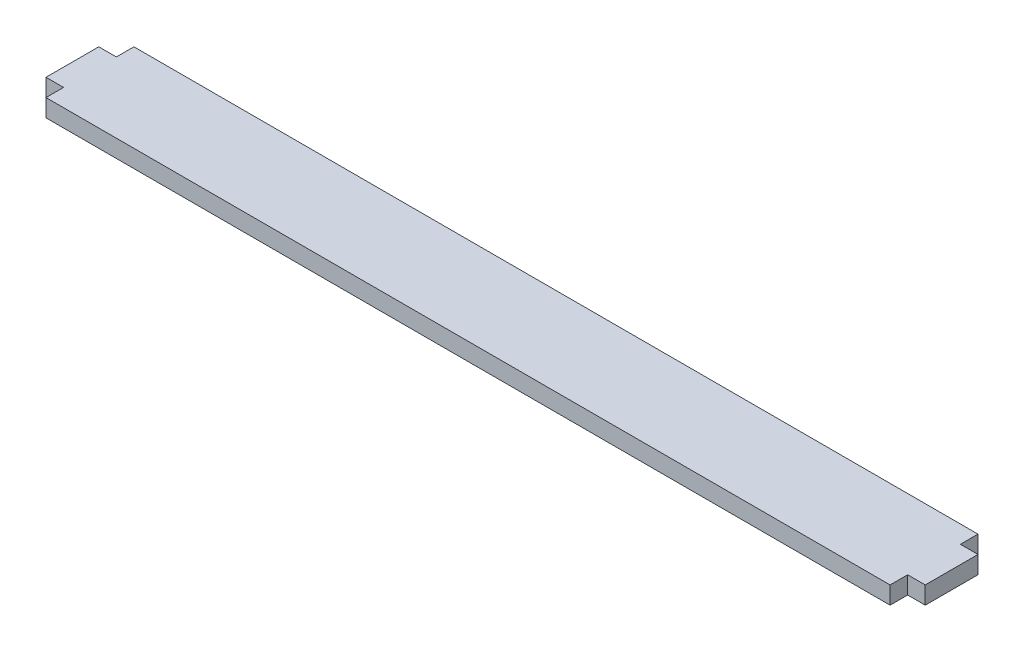
ISO-10303-21;
HEADER;
FILE_DESCRIPTION(('STEP AP214'),'2;1');
FILE_NAME('part.step','',(''),(''),'','','');
FILE_SCHEMA(('AUTOMOTIVE_DESIGN { 1 0 10303 214 1 1 1 1 }'));
ENDSEC;
DATA;
#1=APPLICATION_CONTEXT('core data for automotive mechanical design processes');
#2=APPLICATION_PROTOCOL_DEFINITION('international standard','automotive_design',2000,#1);
#3=PRODUCT_CONTEXT('',#1,'mechanical');
#4=PRODUCT('Part','Part','',(#3));
#5=PRODUCT_RELATED_PRODUCT_CATEGORY('part','',(#4));
#6=PRODUCT_DEFINITION_FORMATION('','',#4);
#7=PRODUCT_DEFINITION_CONTEXT('part definition',#1,'design');
#8=PRODUCT_DEFINITION('design','',#6,#7);
#9=PRODUCT_DEFINITION_SHAPE('','',#8);
#10=(LENGTH_UNIT() NAMED_UNIT(*) SI_UNIT(.MILLI.,.METRE.));
#11=(NAMED_UNIT(*) PLANE_ANGLE_UNIT() SI_UNIT($,.RADIAN.));
#12=(NAMED_UNIT(*) SI_UNIT($,.STERADIAN.) SOLID_ANGLE_UNIT());
#13=UNCERTAINTY_MEASURE_WITH_UNIT(LENGTH_MEASURE(1.E-05),#10,'distance_accuracy_value','');
#14=(GEOMETRIC_REPRESENTATION_CONTEXT(3) GLOBAL_UNCERTAINTY_ASSIGNED_CONTEXT((#13)) GLOBAL_UNIT_ASSIGNED_CONTEXT((#10,
#11,#12)) REPRESENTATION_CONTEXT('',''));
#15=CARTESIAN_POINT('',(0.,0.,0.));
#16=DIRECTION('',(0.,0.,1.));
#17=DIRECTION('',(1.,0.,0.));
#18=AXIS2_PLACEMENT_3D('',#15,#16,#17);
#19=CARTESIAN_POINT('',(-76.2,3.175,4.76249999999999));
#20=DIRECTION('',(1.,0.,0.));
#21=DIRECTION('',(0.,0.,-1.));
#22=AXIS2_PLACEMENT_3D('',#19,#20,#21);
#23=PLANE('',#22);
#24=DIRECTION('',(0.,0.,1.));
#25=VECTOR('',#24,1.);
#26=CARTESIAN_POINT('',(-76.2,0.,4.76249999999999));
#27=LINE('',#26,#25);
#28=CARTESIAN_POINT('',(-76.2,0.,4.76249999999999));
#29=VERTEX_POINT('',#28);
#30=CARTESIAN_POINT('',(-76.2,0.,7.9375));
#31=VERTEX_POINT('',#30);
#32=EDGE_CURVE('E159',#29,#31,#27,.T.);
#33=ORIENTED_EDGE('',*,*,#32,.T.);
#34=DIRECTION('',(0.,-1.,0.));
#35=VECTOR('',#34,1.);
#36=CARTESIAN_POINT('',(-76.2,3.175,7.9375));
#37=LINE('',#36,#35);
#38=CARTESIAN_POINT('',(-76.2,3.175,7.9375));
#39=VERTEX_POINT('',#38);
#40=EDGE_CURVE('E11',#39,#31,#37,.T.);
#41=ORIENTED_EDGE('',*,*,#40,.F.);
#42=DIRECTION('',(0.,0.,1.));
#43=VECTOR('',#42,1.);
#44=CARTESIAN_POINT('',(-76.2,3.175,4.76249999999999));
#45=LINE('',#44,#43);
#46=CARTESIAN_POINT('',(-76.2,3.175,4.76249999999999));
#47=VERTEX_POINT('',#46);
#48=EDGE_CURVE('E181',#47,#39,#45,.T.);
#49=ORIENTED_EDGE('',*,*,#48,.F.);
#50=DIRECTION('',(0.,-1.,0.));
#51=VECTOR('',#50,1.);
#52=CARTESIAN_POINT('',(-76.2,3.175,4.76249999999999));
#53=LINE('',#52,#51);
#54=EDGE_CURVE('E155',#47,#29,#53,.T.);
#55=ORIENTED_EDGE('',*,*,#54,.T.);
#56=EDGE_LOOP('',(#33,#41,#49,#55));
#57=FACE_BOUND('',#56,.T.);
#58=ADVANCED_FACE('F39',(#57),#23,.F.);
#59=CARTESIAN_POINT('',(-76.2,3.175,7.9375));
#60=DIRECTION('',(0.,0.,-1.));
#61=DIRECTION('',(-1.,0.,0.));
#62=AXIS2_PLACEMENT_3D('',#59,#60,#61);
#63=PLANE('',#62);
#64=DIRECTION('',(1.,0.,0.));
#65=VECTOR('',#64,1.);
#66=CARTESIAN_POINT('',(-76.2,0.,7.9375));
#67=LINE('',#66,#65);
#68=CARTESIAN_POINT('',(76.2,0.,7.93750000000001));
#69=VERTEX_POINT('',#68);
#70=EDGE_CURVE('E162',#31,#69,#67,.T.);
#71=ORIENTED_EDGE('',*,*,#70,.T.);
#72=DIRECTION('',(0.,-1.,0.));
#73=VECTOR('',#72,1.);
#74=CARTESIAN_POINT('',(76.2,3.175,7.93750000000001));
#75=LINE('',#74,#73);
#76=CARTESIAN_POINT('',(76.2,3.175,7.93750000000001));
#77=VERTEX_POINT('',#76);
#78=EDGE_CURVE('E47',#77,#69,#75,.T.);
#79=ORIENTED_EDGE('',*,*,#78,.F.);
#80=DIRECTION('',(1.,0.,0.));
#81=VECTOR('',#80,1.);
#82=CARTESIAN_POINT('',(-76.2,3.175,7.9375));
#83=LINE('',#82,#81);
#84=EDGE_CURVE('E110',#39,#77,#83,.T.);
#85=ORIENTED_EDGE('',*,*,#84,.F.);
#86=ORIENTED_EDGE('',*,*,#40,.T.);
#87=EDGE_LOOP('',(#71,#79,#85,#86));
#88=FACE_BOUND('',#87,.T.);
#89=ADVANCED_FACE('F259',(#88),#63,.F.);
#90=CARTESIAN_POINT('',(76.2,3.175,7.93750000000001));
#91=DIRECTION('',(-1.,0.,0.));
#92=DIRECTION('',(0.,0.,1.));
#93=AXIS2_PLACEMENT_3D('',#90,#91,#92);
#94=PLANE('',#93);
#95=DIRECTION('',(0.,0.,-1.));
#96=VECTOR('',#95,1.);
#97=CARTESIAN_POINT('',(76.2,0.,7.93750000000001));
#98=LINE('',#97,#96);
#99=CARTESIAN_POINT('',(76.2,0.,4.76249999999999));
#100=VERTEX_POINT('',#99);
#101=EDGE_CURVE('E164',#69,#100,#98,.T.);
#102=ORIENTED_EDGE('',*,*,#101,.T.);
#103=DIRECTION('',(0.,-1.,0.));
#104=VECTOR('',#103,1.);
#105=CARTESIAN_POINT('',(76.2,3.175,4.76249999999999));
#106=LINE('',#105,#104);
#107=CARTESIAN_POINT('',(76.2,3.175,4.76249999999999));
#108=VERTEX_POINT('',#107);
#109=EDGE_CURVE('E200',#108,#100,#106,.T.);
#110=ORIENTED_EDGE('',*,*,#109,.F.);
#111=DIRECTION('',(0.,0.,-1.));
#112=VECTOR('',#111,1.);
#113=CARTESIAN_POINT('',(76.2,3.175,7.93750000000001));
#114=LINE('',#113,#112);
#115=EDGE_CURVE('E208',#77,#108,#114,.T.);
#116=ORIENTED_EDGE('',*,*,#115,.F.);
#117=ORIENTED_EDGE('',*,*,#78,.T.);
#118=EDGE_LOOP('',(#102,#110,#116,#117));
#119=FACE_BOUND('',#118,.T.);
#120=ADVANCED_FACE('F206',(#119),#94,.F.);
#121=CARTESIAN_POINT('',(76.2,3.175,4.76249999999999));
#122=DIRECTION('',(0.,0.,-1.));
#123=DIRECTION('',(-1.,0.,0.));
#124=AXIS2_PLACEMENT_3D('',#121,#122,#123);
#125=PLANE('',#124);
#126=DIRECTION('',(1.,0.,0.));
#127=VECTOR('',#126,1.);
#128=CARTESIAN_POINT('',(76.2,0.,4.76249999999999));
#129=LINE('',#128,#127);
#130=CARTESIAN_POINT('',(79.375,0.,4.7625));
#131=VERTEX_POINT('',#130);
#132=EDGE_CURVE('E166',#100,#131,#129,.T.);
#133=ORIENTED_EDGE('',*,*,#132,.T.);
#134=DIRECTION('',(0.,-1.,0.));
#135=VECTOR('',#134,1.);
#136=CARTESIAN_POINT('',(79.375,3.175,4.7625));
#137=LINE('',#136,#135);
#138=CARTESIAN_POINT('',(79.375,3.175,4.7625));
#139=VERTEX_POINT('',#138);
#140=EDGE_CURVE('E197',#139,#131,#137,.T.);
#141=ORIENTED_EDGE('',*,*,#140,.F.);
#142=DIRECTION('',(1.,0.,0.));
#143=VECTOR('',#142,1.);
#144=CARTESIAN_POINT('',(76.2,3.175,4.76249999999999));
#145=LINE('',#144,#143);
#146=EDGE_CURVE('E226',#108,#139,#145,.T.);
#147=ORIENTED_EDGE('',*,*,#146,.F.);
#148=ORIENTED_EDGE('',*,*,#109,.T.);
#149=EDGE_LOOP('',(#133,#141,#147,#148));
#150=FACE_BOUND('',#149,.T.);
#151=ADVANCED_FACE('F217',(#150),#125,.F.);
#152=CARTESIAN_POINT('',(79.375,3.175,4.7625));
#153=DIRECTION('',(-1.,0.,0.));
#154=DIRECTION('',(0.,0.,1.));
#155=AXIS2_PLACEMENT_3D('',#152,#153,#154);
#156=PLANE('',#155);
#157=DIRECTION('',(0.,0.,-1.));
#158=VECTOR('',#157,1.);
#159=CARTESIAN_POINT('',(79.375,0.,4.7625));
#160=LINE('',#159,#158);
#161=CARTESIAN_POINT('',(79.375,0.,-4.7625));
#162=VERTEX_POINT('',#161);
#163=EDGE_CURVE('E168',#131,#162,#160,.T.);
#164=ORIENTED_EDGE('',*,*,#163,.T.);
#165=DIRECTION('',(0.,-1.,0.));
#166=VECTOR('',#165,1.);
#167=CARTESIAN_POINT('',(79.375,3.175,-4.7625));
#168=LINE('',#167,#166);
#169=CARTESIAN_POINT('',(79.375,3.175,-4.7625));
#170=VERTEX_POINT('',#169);
#171=EDGE_CURVE('E194',#170,#162,#168,.T.);
#172=ORIENTED_EDGE('',*,*,#171,.F.);
#173=DIRECTION('',(0.,0.,-1.));
#174=VECTOR('',#173,1.);
#175=CARTESIAN_POINT('',(79.375,3.175,4.7625));
#176=LINE('',#175,#174);
#177=EDGE_CURVE('E223',#139,#170,#176,.T.);
#178=ORIENTED_EDGE('',*,*,#177,.F.);
#179=ORIENTED_EDGE('',*,*,#140,.T.);
#180=EDGE_LOOP('',(#164,#172,#178,#179));
#181=FACE_BOUND('',#180,.T.);
#182=ADVANCED_FACE('F221',(#181),#156,.F.);
#183=CARTESIAN_POINT('',(79.375,3.175,-4.7625));
#184=DIRECTION('',(0.,0.,1.));
#185=DIRECTION('',(1.,0.,0.));
#186=AXIS2_PLACEMENT_3D('',#183,#184,#185);
#187=PLANE('',#186);
#188=DIRECTION('',(-1.,0.,0.));
#189=VECTOR('',#188,1.);
#190=CARTESIAN_POINT('',(79.375,0.,-4.7625));
#191=LINE('',#190,#189);
#192=CARTESIAN_POINT('',(76.2,0.,-4.7625));
#193=VERTEX_POINT('',#192);
#194=EDGE_CURVE('E170',#162,#193,#191,.T.);
#195=ORIENTED_EDGE('',*,*,#194,.T.);
#196=DIRECTION('',(0.,-1.,0.));
#197=VECTOR('',#196,1.);
#198=CARTESIAN_POINT('',(76.2,3.175,-4.7625));
#199=LINE('',#198,#197);
#200=CARTESIAN_POINT('',(76.2,3.175,-4.7625));
#201=VERTEX_POINT('',#200);
#202=EDGE_CURVE('E191',#201,#193,#199,.T.);
#203=ORIENTED_EDGE('',*,*,#202,.F.);
#204=DIRECTION('',(-1.,0.,0.));
#205=VECTOR('',#204,1.);
#206=CARTESIAN_POINT('',(79.375,3.175,-4.7625));
#207=LINE('',#206,#205);
#208=EDGE_CURVE('E225',#170,#201,#207,.T.);
#209=ORIENTED_EDGE('',*,*,#208,.F.);
#210=ORIENTED_EDGE('',*,*,#171,.T.);
#211=EDGE_LOOP('',(#195,#203,#209,#210));
#212=FACE_BOUND('',#211,.T.);
#213=ADVANCED_FACE('F272',(#212),#187,.F.);
#214=CARTESIAN_POINT('',(76.2,3.175,-4.7625));
#215=DIRECTION('',(-1.,0.,0.));
#216=DIRECTION('',(0.,0.,1.));
#217=AXIS2_PLACEMENT_3D('',#214,#215,#216);
#218=PLANE('',#217);
#219=DIRECTION('',(0.,0.,-1.));
#220=VECTOR('',#219,1.);
#221=CARTESIAN_POINT('',(76.2,0.,-4.7625));
#222=LINE('',#221,#220);
#223=CARTESIAN_POINT('',(76.2,0.,-7.93750000000001));
#224=VERTEX_POINT('',#223);
#225=EDGE_CURVE('E172',#193,#224,#222,.T.);
#226=ORIENTED_EDGE('',*,*,#225,.T.);
#227=DIRECTION('',(0.,-1.,0.));
#228=VECTOR('',#227,1.);
#229=CARTESIAN_POINT('',(76.2,3.175,-7.93750000000001));
#230=LINE('',#229,#228);
#231=CARTESIAN_POINT('',(76.2,3.175,-7.93750000000001));
#232=VERTEX_POINT('',#231);
#233=EDGE_CURVE('E188',#232,#224,#230,.T.);
#234=ORIENTED_EDGE('',*,*,#233,.F.);
#235=DIRECTION('',(0.,0.,-1.));
#236=VECTOR('',#235,1.);
#237=CARTESIAN_POINT('',(76.2,3.175,-4.7625));
#238=LINE('',#237,#236);
#239=EDGE_CURVE('E228',#201,#232,#238,.T.);
#240=ORIENTED_EDGE('',*,*,#239,.F.);
#241=ORIENTED_EDGE('',*,*,#202,.T.);
#242=EDGE_LOOP('',(#226,#234,#240,#241));
#243=FACE_BOUND('',#242,.T.);
#244=ADVANCED_FACE('F275',(#243),#218,.F.);
#245=CARTESIAN_POINT('',(76.2,3.175,-7.93750000000001));
#246=DIRECTION('',(0.,0.,1.));
#247=DIRECTION('',(1.,0.,0.));
#248=AXIS2_PLACEMENT_3D('',#245,#246,#247);
#249=PLANE('',#248);
#250=DIRECTION('',(-1.,0.,0.));
#251=VECTOR('',#250,1.);
#252=CARTESIAN_POINT('',(76.2,0.,-7.93750000000001));
#253=LINE('',#252,#251);
#254=CARTESIAN_POINT('',(-76.2,0.,-7.93750000000001));
#255=VERTEX_POINT('',#254);
#256=EDGE_CURVE('E174',#224,#255,#253,.T.);
#257=ORIENTED_EDGE('',*,*,#256,.T.);
#258=DIRECTION('',(0.,-1.,0.));
#259=VECTOR('',#258,1.);
#260=CARTESIAN_POINT('',(-76.2,3.175,-7.93750000000001));
#261=LINE('',#260,#259);
#262=CARTESIAN_POINT('',(-76.2,3.175,-7.93750000000001));
#263=VERTEX_POINT('',#262);
#264=EDGE_CURVE('E185',#263,#255,#261,.T.);
#265=ORIENTED_EDGE('',*,*,#264,.F.);
#266=DIRECTION('',(-1.,0.,0.));
#267=VECTOR('',#266,1.);
#268=CARTESIAN_POINT('',(76.2,3.175,-7.93750000000001));
#269=LINE('',#268,#267);
#270=EDGE_CURVE('E234',#232,#263,#269,.T.);
#271=ORIENTED_EDGE('',*,*,#270,.F.);
#272=ORIENTED_EDGE('',*,*,#233,.T.);
#273=EDGE_LOOP('',(#257,#265,#271,#272));
#274=FACE_BOUND('',#273,.T.);
#275=ADVANCED_FACE('F240',(#274),#249,.F.);
#276=CARTESIAN_POINT('',(-76.2,3.175,-7.93750000000001));
#277=DIRECTION('',(1.,0.,0.));
#278=DIRECTION('',(0.,0.,-1.));
#279=AXIS2_PLACEMENT_3D('',#276,#277,#278);
#280=PLANE('',#279);
#281=DIRECTION('',(0.,0.,1.));
#282=VECTOR('',#281,1.);
#283=CARTESIAN_POINT('',(-76.2,0.,-7.93750000000001));
#284=LINE('',#283,#282);
#285=CARTESIAN_POINT('',(-76.2,0.,-4.7625));
#286=VERTEX_POINT('',#285);
#287=EDGE_CURVE('E176',#255,#286,#284,.T.);
#288=ORIENTED_EDGE('',*,*,#287,.T.);
#289=DIRECTION('',(0.,-1.,0.));
#290=VECTOR('',#289,1.);
#291=CARTESIAN_POINT('',(-76.2,3.175,-4.7625));
#292=LINE('',#291,#290);
#293=CARTESIAN_POINT('',(-76.2,3.175,-4.7625));
#294=VERTEX_POINT('',#293);
#295=EDGE_CURVE('E150',#294,#286,#292,.T.);
#296=ORIENTED_EDGE('',*,*,#295,.F.);
#297=DIRECTION('',(0.,0.,1.));
#298=VECTOR('',#297,1.);
#299=CARTESIAN_POINT('',(-76.2,3.175,-7.93750000000001));
#300=LINE('',#299,#298);
#301=EDGE_CURVE('E141',#263,#294,#300,.T.);
#302=ORIENTED_EDGE('',*,*,#301,.F.);
#303=ORIENTED_EDGE('',*,*,#264,.T.);
#304=EDGE_LOOP('',(#288,#296,#302,#303));
#305=FACE_BOUND('',#304,.T.);
#306=ADVANCED_FACE('F244',(#305),#280,.F.);
#307=CARTESIAN_POINT('',(-76.2,3.175,-4.7625));
#308=DIRECTION('',(0.,0.,1.));
#309=DIRECTION('',(1.,0.,0.));
#310=AXIS2_PLACEMENT_3D('',#307,#308,#309);
#311=PLANE('',#310);
#312=DIRECTION('',(-1.,0.,0.));
#313=VECTOR('',#312,1.);
#314=CARTESIAN_POINT('',(-76.2,0.,-4.7625));
#315=LINE('',#314,#313);
#316=CARTESIAN_POINT('',(-79.375,0.,-4.7625));
#317=VERTEX_POINT('',#316);
#318=EDGE_CURVE('E149',#286,#317,#315,.T.);
#319=ORIENTED_EDGE('',*,*,#318,.T.);
#320=DIRECTION('',(0.,-1.,0.));
#321=VECTOR('',#320,1.);
#322=CARTESIAN_POINT('',(-79.375,3.175,-4.7625));
#323=LINE('',#322,#321);
#324=CARTESIAN_POINT('',(-79.375,3.175,-4.7625));
#325=VERTEX_POINT('',#324);
#326=EDGE_CURVE('E146',#325,#317,#323,.T.);
#327=ORIENTED_EDGE('',*,*,#326,.F.);
#328=DIRECTION('',(-1.,0.,0.));
#329=VECTOR('',#328,1.);
#330=CARTESIAN_POINT('',(-76.2,3.175,-4.7625));
#331=LINE('',#330,#329);
#332=EDGE_CURVE('E135',#294,#325,#331,.T.);
#333=ORIENTED_EDGE('',*,*,#332,.F.);
#334=ORIENTED_EDGE('',*,*,#295,.T.);
#335=EDGE_LOOP('',(#319,#327,#333,#334));
#336=FACE_BOUND('',#335,.T.);
#337=ADVANCED_FACE('F147',(#336),#311,.F.);
#338=CARTESIAN_POINT('',(-79.375,3.175,-4.7625));
#339=DIRECTION('',(1.,0.,0.));
#340=DIRECTION('',(0.,0.,-1.));
#341=AXIS2_PLACEMENT_3D('',#338,#339,#340);
#342=PLANE('',#341);
#343=DIRECTION('',(0.,0.,1.));
#344=VECTOR('',#343,1.);
#345=CARTESIAN_POINT('',(-79.375,0.,-4.7625));
#346=LINE('',#345,#344);
#347=CARTESIAN_POINT('',(-79.375,0.,4.7625));
#348=VERTEX_POINT('',#347);
#349=EDGE_CURVE('E96',#317,#348,#346,.T.);
#350=ORIENTED_EDGE('',*,*,#349,.T.);
#351=DIRECTION('',(0.,-1.,0.));
#352=VECTOR('',#351,1.);
#353=CARTESIAN_POINT('',(-79.375,3.175,4.7625));
#354=LINE('',#353,#352);
#355=CARTESIAN_POINT('',(-79.375,3.175,4.7625));
#356=VERTEX_POINT('',#355);
#357=EDGE_CURVE('E151',#356,#348,#354,.T.);
#358=ORIENTED_EDGE('',*,*,#357,.F.);
#359=DIRECTION('',(0.,0.,1.));
#360=VECTOR('',#359,1.);
#361=CARTESIAN_POINT('',(-79.375,3.175,-4.7625));
#362=LINE('',#361,#360);
#363=EDGE_CURVE('E139',#325,#356,#362,.T.);
#364=ORIENTED_EDGE('',*,*,#363,.F.);
#365=ORIENTED_EDGE('',*,*,#326,.T.);
#366=EDGE_LOOP('',(#350,#358,#364,#365));
#367=FACE_BOUND('',#366,.T.);
#368=ADVANCED_FACE('F153',(#367),#342,.F.);
#369=CARTESIAN_POINT('',(-79.375,3.175,4.7625));
#370=DIRECTION('',(0.,0.,-1.));
#371=DIRECTION('',(-1.,0.,0.));
#372=AXIS2_PLACEMENT_3D('',#369,#370,#371);
#373=PLANE('',#372);
#374=DIRECTION('',(1.,0.,0.));
#375=VECTOR('',#374,1.);
#376=CARTESIAN_POINT('',(-79.375,0.,4.7625));
#377=LINE('',#376,#375);
#378=EDGE_CURVE('E102',#348,#29,#377,.T.);
#379=ORIENTED_EDGE('',*,*,#378,.T.);
#380=ORIENTED_EDGE('',*,*,#54,.F.);
#381=DIRECTION('',(1.,0.,0.));
#382=VECTOR('',#381,1.);
#383=CARTESIAN_POINT('',(-79.375,3.175,4.7625));
#384=LINE('',#383,#382);
#385=EDGE_CURVE('E55',#356,#47,#384,.T.);
#386=ORIENTED_EDGE('',*,*,#385,.F.);
#387=ORIENTED_EDGE('',*,*,#357,.T.);
#388=EDGE_LOOP('',(#379,#380,#386,#387));
#389=FACE_BOUND('',#388,.T.);
#390=ADVANCED_FACE('F248',(#389),#373,.F.);
#391=CARTESIAN_POINT('',(0.,3.175,0.));
#392=DIRECTION('',(0.,1.,0.));
#393=DIRECTION('',(0.,0.,1.));
#394=AXIS2_PLACEMENT_3D('',#391,#392,#393);
#395=PLANE('',#394);
#396=ORIENTED_EDGE('',*,*,#48,.T.);
#397=ORIENTED_EDGE('',*,*,#84,.T.);
#398=ORIENTED_EDGE('',*,*,#115,.T.);
#399=ORIENTED_EDGE('',*,*,#146,.T.);
#400=ORIENTED_EDGE('',*,*,#177,.T.);
#401=ORIENTED_EDGE('',*,*,#208,.T.);
#402=ORIENTED_EDGE('',*,*,#239,.T.);
#403=ORIENTED_EDGE('',*,*,#270,.T.);
#404=ORIENTED_EDGE('',*,*,#301,.T.);
#405=ORIENTED_EDGE('',*,*,#332,.T.);
#406=ORIENTED_EDGE('',*,*,#363,.T.);
#407=ORIENTED_EDGE('',*,*,#385,.T.);
#408=EDGE_LOOP('',(#396,#397,#398,#399,#400,#401,#402,#403,#404,#405,#406,#407));
#409=FACE_BOUND('',#408,.T.);
#410=ADVANCED_FACE('F137',(#409),#395,.T.);
#411=CARTESIAN_POINT('',(0.,0.,0.));
#412=DIRECTION('',(0.,1.,0.));
#413=DIRECTION('',(0.,0.,1.));
#414=AXIS2_PLACEMENT_3D('',#411,#412,#413);
#415=PLANE('',#414);
#416=ORIENTED_EDGE('',*,*,#32,.F.);
#417=ORIENTED_EDGE('',*,*,#378,.F.);
#418=ORIENTED_EDGE('',*,*,#349,.F.);
#419=ORIENTED_EDGE('',*,*,#318,.F.);
#420=ORIENTED_EDGE('',*,*,#287,.F.);
#421=ORIENTED_EDGE('',*,*,#256,.F.);
#422=ORIENTED_EDGE('',*,*,#225,.F.);
#423=ORIENTED_EDGE('',*,*,#194,.F.);
#424=ORIENTED_EDGE('',*,*,#163,.F.);
#425=ORIENTED_EDGE('',*,*,#132,.F.);
#426=ORIENTED_EDGE('',*,*,#101,.F.);
#427=ORIENTED_EDGE('',*,*,#70,.F.);
#428=EDGE_LOOP('',(#416,#417,#418,#419,#420,#421,#422,#423,#424,#425,#426,#427));
#429=FACE_BOUND('',#428,.T.);
#430=ADVANCED_FACE('F212',(#429),#415,.F.);
#431=CLOSED_SHELL('',(#58,#89,#120,#151,#182,#213,#244,#275,#306,#337,#368,#390,#410,#430));
#432=MANIFOLD_SOLID_BREP('B2',#431);
#433=ADVANCED_BREP_SHAPE_REPRESENTATION('',(#18,#432),#14);
#434=SHAPE_DEFINITION_REPRESENTATION(#9,#433);
ENDSEC;
END-ISO-10303-21;
